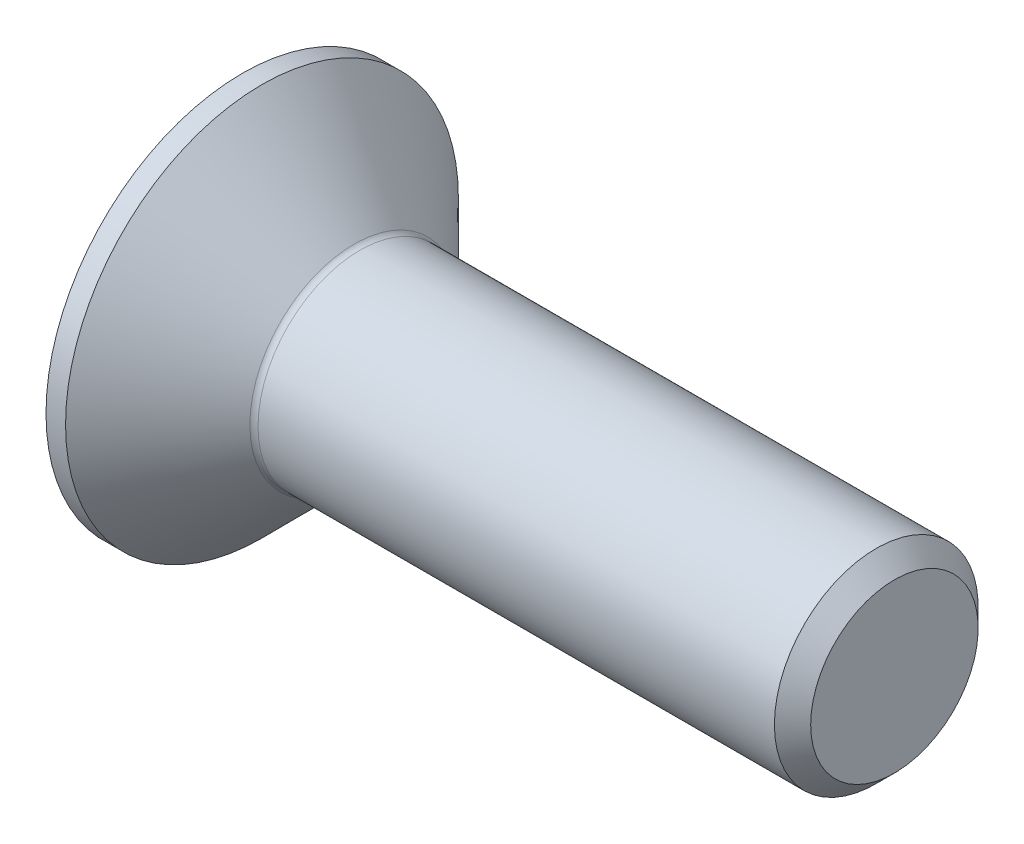
ISO-10303-21;
HEADER;
FILE_DESCRIPTION(('STEP AP214'),'2;1');
FILE_NAME('part.step','',(''),(''),'','','');
FILE_SCHEMA(('AUTOMOTIVE_DESIGN { 1 0 10303 214 1 1 1 1 }'));
ENDSEC;
DATA;
#1=APPLICATION_CONTEXT('core data for automotive mechanical design processes');
#2=APPLICATION_PROTOCOL_DEFINITION('international standard','automotive_design',2000,#1);
#3=PRODUCT_CONTEXT('',#1,'mechanical');
#4=PRODUCT('Part','Part','',(#3));
#5=PRODUCT_RELATED_PRODUCT_CATEGORY('part','',(#4));
#6=PRODUCT_DEFINITION_FORMATION('','',#4);
#7=PRODUCT_DEFINITION_CONTEXT('part definition',#1,'design');
#8=PRODUCT_DEFINITION('design','',#6,#7);
#9=PRODUCT_DEFINITION_SHAPE('','',#8);
#10=(LENGTH_UNIT() NAMED_UNIT(*) SI_UNIT(.MILLI.,.METRE.));
#11=(NAMED_UNIT(*) PLANE_ANGLE_UNIT() SI_UNIT($,.RADIAN.));
#12=(NAMED_UNIT(*) SI_UNIT($,.STERADIAN.) SOLID_ANGLE_UNIT());
#13=UNCERTAINTY_MEASURE_WITH_UNIT(LENGTH_MEASURE(1.E-05),#10,'distance_accuracy_value','');
#14=(GEOMETRIC_REPRESENTATION_CONTEXT(3) GLOBAL_UNCERTAINTY_ASSIGNED_CONTEXT((#13)) GLOBAL_UNIT_ASSIGNED_CONTEXT((#10,
#11,#12)) REPRESENTATION_CONTEXT('',''));
#15=CARTESIAN_POINT('',(0.,0.,0.));
#16=DIRECTION('',(0.,0.,1.));
#17=DIRECTION('',(1.,0.,0.));
#18=AXIS2_PLACEMENT_3D('',#15,#16,#17);
#19=CARTESIAN_POINT('',(0.,0.,0.));
#20=DIRECTION('',(-1.,0.,0.));
#21=DIRECTION('',(0.,0.,1.));
#22=AXIS2_PLACEMENT_3D('',#19,#20,#21);
#23=PLANE('',#22);
#24=CARTESIAN_POINT('',(0.,0.,0.));
#25=DIRECTION('',(-1.,0.,0.));
#26=DIRECTION('',(0.,0.,1.));
#27=AXIS2_PLACEMENT_3D('',#24,#25,#26);
#28=CIRCLE('',#27,4.82);
#29=CARTESIAN_POINT('',(0.,0.,4.82));
#30=VERTEX_POINT('',#29);
#31=EDGE_CURVE('E152',#30,#30,#28,.T.);
#32=ORIENTED_EDGE('',*,*,#31,.T.);
#33=EDGE_LOOP('',(#32));
#34=FACE_BOUND('',#33,.T.);
#35=DIRECTION('',(0.,-0.499999999999999,-0.866025403784439));
#36=VECTOR('',#35,1.);
#37=CARTESIAN_POINT('',(0.,-0.871798906476334,1.51));
#38=LINE('',#37,#36);
#39=CARTESIAN_POINT('',(0.,-0.871798906476334,1.51));
#40=VERTEX_POINT('',#39);
#41=CARTESIAN_POINT('',(0.,-1.74359781295267,0.));
#42=VERTEX_POINT('',#41);
#43=EDGE_CURVE('E118',#40,#42,#38,.T.);
#44=ORIENTED_EDGE('',*,*,#43,.T.);
#45=DIRECTION('',(0.,0.499999999999999,-0.866025403784439));
#46=VECTOR('',#45,1.);
#47=CARTESIAN_POINT('',(0.,-1.74359781295267,0.));
#48=LINE('',#47,#46);
#49=CARTESIAN_POINT('',(0.,-0.871798906476335,-1.51));
#50=VERTEX_POINT('',#49);
#51=EDGE_CURVE('E49',#42,#50,#48,.T.);
#52=ORIENTED_EDGE('',*,*,#51,.T.);
#53=DIRECTION('',(0.,1.,0.));
#54=VECTOR('',#53,1.);
#55=CARTESIAN_POINT('',(0.,-0.871798906476335,-1.51));
#56=LINE('',#55,#54);
#57=CARTESIAN_POINT('',(0.,0.871798906476334,-1.51));
#58=VERTEX_POINT('',#57);
#59=EDGE_CURVE('E129',#50,#58,#56,.T.);
#60=ORIENTED_EDGE('',*,*,#59,.T.);
#61=DIRECTION('',(0.,0.500000000000002,0.866025403784437));
#62=VECTOR('',#61,1.);
#63=CARTESIAN_POINT('',(0.,0.871798906476334,-1.51));
#64=LINE('',#63,#62);
#65=CARTESIAN_POINT('',(0.,1.74359781295267,0.));
#66=VERTEX_POINT('',#65);
#67=EDGE_CURVE('E253',#58,#66,#64,.T.);
#68=ORIENTED_EDGE('',*,*,#67,.T.);
#69=DIRECTION('',(0.,-0.500000000000001,0.866025403784438));
#70=VECTOR('',#69,1.);
#71=CARTESIAN_POINT('',(0.,1.74359781295267,0.));
#72=LINE('',#71,#70);
#73=CARTESIAN_POINT('',(0.,0.871798906476334,1.51));
#74=VERTEX_POINT('',#73);
#75=EDGE_CURVE('E256',#66,#74,#72,.T.);
#76=ORIENTED_EDGE('',*,*,#75,.T.);
#77=DIRECTION('',(0.,-1.,0.));
#78=VECTOR('',#77,1.);
#79=CARTESIAN_POINT('',(0.,0.871798906476334,1.51));
#80=LINE('',#79,#78);
#81=EDGE_CURVE('E259',#74,#40,#80,.T.);
#82=ORIENTED_EDGE('',*,*,#81,.T.);
#83=EDGE_LOOP('',(#44,#52,#60,#68,#76,#82));
#84=FACE_BOUND('',#83,.T.);
#85=ADVANCED_FACE('F34',(#34,#84),#23,.T.);
#86=CARTESIAN_POINT('',(0.,0.,0.));
#87=DIRECTION('',(-1.,0.,0.));
#88=DIRECTION('',(0.,0.,1.));
#89=AXIS2_PLACEMENT_3D('',#86,#87,#88);
#90=CYLINDRICAL_SURFACE('',#89,4.82);
#91=CARTESIAN_POINT('',(0.480000000000012,0.,0.));
#92=DIRECTION('',(-1.,0.,0.));
#93=DIRECTION('',(0.,0.,1.));
#94=AXIS2_PLACEMENT_3D('',#91,#92,#93);
#95=CIRCLE('',#94,4.82);
#96=CARTESIAN_POINT('',(0.480000000000012,0.,4.82));
#97=VERTEX_POINT('',#96);
#98=EDGE_CURVE('E149',#97,#97,#95,.T.);
#99=ORIENTED_EDGE('',*,*,#98,.T.);
#100=EDGE_LOOP('',(#99));
#101=FACE_BOUND('',#100,.T.);
#102=ORIENTED_EDGE('',*,*,#31,.F.);
#103=EDGE_LOOP('',(#102));
#104=FACE_BOUND('',#103,.T.);
#105=ADVANCED_FACE('F173',(#101,#104),#90,.T.);
#106=CARTESIAN_POINT('',(0.480000000000012,0.,0.));
#107=DIRECTION('',(-1.,0.,0.));
#108=DIRECTION('',(0.,0.,1.));
#109=AXIS2_PLACEMENT_3D('',#106,#107,#108);
#110=CONICAL_SURFACE('',#109,4.82,0.78539816339745);
#111=CARTESIAN_POINT('',(2.74142135623731,0.,0.));
#112=DIRECTION('',(-1.,0.,0.));
#113=DIRECTION('',(0.,0.,1.));
#114=AXIS2_PLACEMENT_3D('',#111,#112,#113);
#115=CIRCLE('',#114,2.55857864376269);
#116=CARTESIAN_POINT('',(2.74142135623731,0.,2.55857864376269));
#117=VERTEX_POINT('',#116);
#118=EDGE_CURVE('E42',#117,#117,#115,.T.);
#119=ORIENTED_EDGE('',*,*,#118,.T.);
#120=EDGE_LOOP('',(#119));
#121=FACE_BOUND('',#120,.T.);
#122=ORIENTED_EDGE('',*,*,#98,.F.);
#123=EDGE_LOOP('',(#122));
#124=FACE_BOUND('',#123,.T.);
#125=ADVANCED_FACE('F157',(#121,#124),#110,.T.);
#126=CARTESIAN_POINT('',(0.,0.,0.));
#127=DIRECTION('',(-1.,0.,0.));
#128=DIRECTION('',(0.,0.,1.));
#129=AXIS2_PLACEMENT_3D('',#126,#127,#128);
#130=CYLINDRICAL_SURFACE('',#129,2.5);
#131=CARTESIAN_POINT('',(2.88284271247462,0.,0.));
#132=DIRECTION('',(-1.,0.,0.));
#133=DIRECTION('',(0.,0.,1.));
#134=AXIS2_PLACEMENT_3D('',#131,#132,#133);
#135=CIRCLE('',#134,2.5);
#136=CARTESIAN_POINT('',(2.88284271247462,0.,2.5));
#137=VERTEX_POINT('',#136);
#138=EDGE_CURVE('E11',#137,#137,#135,.F.);
#139=ORIENTED_EDGE('',*,*,#138,.T.);
#140=EDGE_LOOP('',(#139));
#141=FACE_BOUND('',#140,.T.);
#142=CARTESIAN_POINT('',(15.555,0.,0.));
#143=DIRECTION('',(-1.,0.,0.));
#144=DIRECTION('',(0.,0.,1.));
#145=AXIS2_PLACEMENT_3D('',#142,#143,#144);
#146=CIRCLE('',#145,2.5);
#147=CARTESIAN_POINT('',(15.555,0.,2.5));
#148=VERTEX_POINT('',#147);
#149=EDGE_CURVE('E146',#148,#148,#146,.T.);
#150=ORIENTED_EDGE('',*,*,#149,.T.);
#151=EDGE_LOOP('',(#150));
#152=FACE_BOUND('',#151,.T.);
#153=ADVANCED_FACE('F184',(#141,#152),#130,.T.);
#154=CARTESIAN_POINT('',(16.,0.,0.));
#155=DIRECTION('',(-1.,0.,0.));
#156=DIRECTION('',(0.,0.,1.));
#157=AXIS2_PLACEMENT_3D('',#154,#155,#156);
#158=CONICAL_SURFACE('',#157,2.055,0.785398163397449);
#159=ORIENTED_EDGE('',*,*,#149,.F.);
#160=EDGE_LOOP('',(#159));
#161=FACE_BOUND('',#160,.T.);
#162=CARTESIAN_POINT('',(16.,0.,0.));
#163=DIRECTION('',(-1.,0.,0.));
#164=DIRECTION('',(0.,0.,1.));
#165=AXIS2_PLACEMENT_3D('',#162,#163,#164);
#166=CIRCLE('',#165,2.055);
#167=CARTESIAN_POINT('',(16.,0.,2.055));
#168=VERTEX_POINT('',#167);
#169=EDGE_CURVE('E142',#168,#168,#166,.T.);
#170=ORIENTED_EDGE('',*,*,#169,.T.);
#171=EDGE_LOOP('',(#170));
#172=FACE_BOUND('',#171,.T.);
#173=ADVANCED_FACE('F168',(#161,#172),#158,.T.);
#174=CARTESIAN_POINT('',(16.,2.055,0.));
#175=DIRECTION('',(1.,0.,0.));
#176=DIRECTION('',(0.,0.,-1.));
#177=AXIS2_PLACEMENT_3D('',#174,#175,#176);
#178=PLANE('',#177);
#179=ORIENTED_EDGE('',*,*,#169,.F.);
#180=EDGE_LOOP('',(#179));
#181=FACE_BOUND('',#180,.T.);
#182=ADVANCED_FACE('F161',(#181),#178,.T.);
#183=CARTESIAN_POINT('',(2.88284271247462,0.,0.));
#184=DIRECTION('',(-1.,0.,0.));
#185=DIRECTION('',(0.,0.,1.));
#186=AXIS2_PLACEMENT_3D('',#183,#184,#185);
#187=TOROIDAL_SURFACE('',#186,2.7,0.2);
#188=ORIENTED_EDGE('',*,*,#138,.F.);
#189=EDGE_LOOP('',(#188));
#190=FACE_BOUND('',#189,.T.);
#191=ORIENTED_EDGE('',*,*,#118,.F.);
#192=EDGE_LOOP('',(#191));
#193=FACE_BOUND('',#192,.T.);
#194=ADVANCED_FACE('F36',(#190,#193),#187,.F.);
#195=CARTESIAN_POINT('',(2.3,-1.74359781295267,0.));
#196=DIRECTION('',(0.,0.866025403784439,0.499999999999999));
#197=DIRECTION('',(0.,-0.499999999999999,0.866025403784439));
#198=AXIS2_PLACEMENT_3D('',#195,#196,#197);
#199=PLANE('',#198);
#200=ORIENTED_EDGE('',*,*,#51,.F.);
#201=DIRECTION('',(-1.,0.,0.));
#202=VECTOR('',#201,1.);
#203=CARTESIAN_POINT('',(2.3,-1.74359781295267,0.));
#204=LINE('',#203,#202);
#205=CARTESIAN_POINT('',(2.3,-1.74359781295267,0.));
#206=VERTEX_POINT('',#205);
#207=EDGE_CURVE('E250',#206,#42,#204,.T.);
#208=ORIENTED_EDGE('',*,*,#207,.F.);
#209=DIRECTION('',(0.,0.499999999999999,-0.866025403784439));
#210=VECTOR('',#209,1.);
#211=CARTESIAN_POINT('',(2.3,-1.74359781295267,0.));
#212=LINE('',#211,#210);
#213=CARTESIAN_POINT('',(2.3,-1.3076983597145,-0.754999999999997));
#214=VERTEX_POINT('',#213);
#215=EDGE_CURVE('E114',#206,#214,#212,.T.);
#216=ORIENTED_EDGE('',*,*,#215,.T.);
#217=CARTESIAN_POINT('',(2.3,-0.871798906476335,-1.51));
#218=VERTEX_POINT('',#217);
#219=EDGE_CURVE('E110',#214,#218,#212,.T.);
#220=ORIENTED_EDGE('',*,*,#219,.T.);
#221=DIRECTION('',(-1.,0.,0.));
#222=VECTOR('',#221,1.);
#223=CARTESIAN_POINT('',(2.3,-0.871798906476335,-1.51));
#224=LINE('',#223,#222);
#225=EDGE_CURVE('E112',#218,#50,#224,.T.);
#226=ORIENTED_EDGE('',*,*,#225,.T.);
#227=EDGE_LOOP('',(#200,#208,#216,#220,#226));
#228=FACE_BOUND('',#227,.T.);
#229=ADVANCED_FACE('F111',(#228),#199,.T.);
#230=CARTESIAN_POINT('',(2.3,-0.871798906476335,-1.51));
#231=DIRECTION('',(0.,0.,1.));
#232=DIRECTION('',(0.,-1.,0.));
#233=AXIS2_PLACEMENT_3D('',#230,#231,#232);
#234=PLANE('',#233);
#235=ORIENTED_EDGE('',*,*,#59,.F.);
#236=ORIENTED_EDGE('',*,*,#225,.F.);
#237=DIRECTION('',(0.,1.,0.));
#238=VECTOR('',#237,1.);
#239=CARTESIAN_POINT('',(2.3,-0.871798906476335,-1.51));
#240=LINE('',#239,#238);
#241=CARTESIAN_POINT('',(2.3,0.,-1.51));
#242=VERTEX_POINT('',#241);
#243=EDGE_CURVE('E57',#218,#242,#240,.T.);
#244=ORIENTED_EDGE('',*,*,#243,.T.);
#245=CARTESIAN_POINT('',(2.3,0.871798906476334,-1.51));
#246=VERTEX_POINT('',#245);
#247=EDGE_CURVE('E124',#242,#246,#240,.T.);
#248=ORIENTED_EDGE('',*,*,#247,.T.);
#249=DIRECTION('',(-1.,0.,0.));
#250=VECTOR('',#249,1.);
#251=CARTESIAN_POINT('',(2.3,0.871798906476334,-1.51));
#252=LINE('',#251,#250);
#253=EDGE_CURVE('E131',#246,#58,#252,.T.);
#254=ORIENTED_EDGE('',*,*,#253,.T.);
#255=EDGE_LOOP('',(#235,#236,#244,#248,#254));
#256=FACE_BOUND('',#255,.T.);
#257=ADVANCED_FACE('F126',(#256),#234,.T.);
#258=CARTESIAN_POINT('',(2.3,0.871798906476334,-1.51));
#259=DIRECTION('',(0.,-0.866025403784437,0.500000000000002));
#260=DIRECTION('',(0.,-0.500000000000002,-0.866025403784437));
#261=AXIS2_PLACEMENT_3D('',#258,#259,#260);
#262=PLANE('',#261);
#263=ORIENTED_EDGE('',*,*,#67,.F.);
#264=ORIENTED_EDGE('',*,*,#253,.F.);
#265=DIRECTION('',(0.,0.500000000000002,0.866025403784437));
#266=VECTOR('',#265,1.);
#267=CARTESIAN_POINT('',(2.3,0.871798906476334,-1.51));
#268=LINE('',#267,#266);
#269=CARTESIAN_POINT('',(2.3,1.3076983597145,-0.755000000000003));
#270=VERTEX_POINT('',#269);
#271=EDGE_CURVE('E231',#246,#270,#268,.T.);
#272=ORIENTED_EDGE('',*,*,#271,.T.);
#273=CARTESIAN_POINT('',(2.3,1.74359781295267,0.));
#274=VERTEX_POINT('',#273);
#275=EDGE_CURVE('E123',#270,#274,#268,.T.);
#276=ORIENTED_EDGE('',*,*,#275,.T.);
#277=DIRECTION('',(-1.,0.,0.));
#278=VECTOR('',#277,1.);
#279=CARTESIAN_POINT('',(2.3,1.74359781295267,0.));
#280=LINE('',#279,#278);
#281=EDGE_CURVE('E137',#274,#66,#280,.T.);
#282=ORIENTED_EDGE('',*,*,#281,.T.);
#283=EDGE_LOOP('',(#263,#264,#272,#276,#282));
#284=FACE_BOUND('',#283,.T.);
#285=ADVANCED_FACE('F198',(#284),#262,.T.);
#286=CARTESIAN_POINT('',(2.3,1.74359781295267,0.));
#287=DIRECTION('',(0.,-0.866025403784438,-0.500000000000001));
#288=DIRECTION('',(0.,0.500000000000001,-0.866025403784438));
#289=AXIS2_PLACEMENT_3D('',#286,#287,#288);
#290=PLANE('',#289);
#291=ORIENTED_EDGE('',*,*,#75,.F.);
#292=ORIENTED_EDGE('',*,*,#281,.F.);
#293=DIRECTION('',(0.,-0.500000000000001,0.866025403784438));
#294=VECTOR('',#293,1.);
#295=CARTESIAN_POINT('',(2.3,1.74359781295267,0.));
#296=LINE('',#295,#294);
#297=CARTESIAN_POINT('',(2.3,1.3076983597145,0.755000000000001));
#298=VERTEX_POINT('',#297);
#299=EDGE_CURVE('E238',#274,#298,#296,.T.);
#300=ORIENTED_EDGE('',*,*,#299,.T.);
#301=CARTESIAN_POINT('',(2.3,0.871798906476334,1.51));
#302=VERTEX_POINT('',#301);
#303=EDGE_CURVE('E236',#298,#302,#296,.T.);
#304=ORIENTED_EDGE('',*,*,#303,.T.);
#305=DIRECTION('',(-1.,0.,0.));
#306=VECTOR('',#305,1.);
#307=CARTESIAN_POINT('',(2.3,0.871798906476334,1.51));
#308=LINE('',#307,#306);
#309=EDGE_CURVE('E268',#302,#74,#308,.T.);
#310=ORIENTED_EDGE('',*,*,#309,.T.);
#311=EDGE_LOOP('',(#291,#292,#300,#304,#310));
#312=FACE_BOUND('',#311,.T.);
#313=ADVANCED_FACE('F201',(#312),#290,.T.);
#314=CARTESIAN_POINT('',(2.3,0.871798906476334,1.51));
#315=DIRECTION('',(0.,0.,-1.));
#316=DIRECTION('',(-1.,0.,0.));
#317=AXIS2_PLACEMENT_3D('',#314,#315,#316);
#318=PLANE('',#317);
#319=ORIENTED_EDGE('',*,*,#81,.F.);
#320=ORIENTED_EDGE('',*,*,#309,.F.);
#321=DIRECTION('',(0.,-1.,0.));
#322=VECTOR('',#321,1.);
#323=CARTESIAN_POINT('',(2.3,0.871798906476334,1.51));
#324=LINE('',#323,#322);
#325=CARTESIAN_POINT('',(2.3,0.,1.51));
#326=VERTEX_POINT('',#325);
#327=EDGE_CURVE('E243',#302,#326,#324,.T.);
#328=ORIENTED_EDGE('',*,*,#327,.T.);
#329=CARTESIAN_POINT('',(2.3,-0.871798906476334,1.51));
#330=VERTEX_POINT('',#329);
#331=EDGE_CURVE('E242',#326,#330,#324,.T.);
#332=ORIENTED_EDGE('',*,*,#331,.T.);
#333=DIRECTION('',(-1.,0.,0.));
#334=VECTOR('',#333,1.);
#335=CARTESIAN_POINT('',(2.3,-0.871798906476334,1.51));
#336=LINE('',#335,#334);
#337=EDGE_CURVE('E265',#330,#40,#336,.T.);
#338=ORIENTED_EDGE('',*,*,#337,.T.);
#339=EDGE_LOOP('',(#319,#320,#328,#332,#338));
#340=FACE_BOUND('',#339,.T.);
#341=ADVANCED_FACE('F205',(#340),#318,.T.);
#342=CARTESIAN_POINT('',(2.3,-0.871798906476334,1.51));
#343=DIRECTION('',(0.,0.866025403784439,-0.499999999999999));
#344=DIRECTION('',(0.,0.499999999999999,0.866025403784439));
#345=AXIS2_PLACEMENT_3D('',#342,#343,#344);
#346=PLANE('',#345);
#347=ORIENTED_EDGE('',*,*,#43,.F.);
#348=ORIENTED_EDGE('',*,*,#337,.F.);
#349=DIRECTION('',(0.,-0.499999999999999,-0.866025403784439));
#350=VECTOR('',#349,1.);
#351=CARTESIAN_POINT('',(2.3,-0.871798906476334,1.51));
#352=LINE('',#351,#350);
#353=CARTESIAN_POINT('',(2.3,-1.3076983597145,0.754999999999998));
#354=VERTEX_POINT('',#353);
#355=EDGE_CURVE('E247',#330,#354,#352,.T.);
#356=ORIENTED_EDGE('',*,*,#355,.T.);
#357=EDGE_CURVE('E246',#354,#206,#352,.T.);
#358=ORIENTED_EDGE('',*,*,#357,.T.);
#359=ORIENTED_EDGE('',*,*,#207,.T.);
#360=EDGE_LOOP('',(#347,#348,#356,#358,#359));
#361=FACE_BOUND('',#360,.T.);
#362=ADVANCED_FACE('F209',(#361),#346,.T.);
#363=CARTESIAN_POINT('',(2.3,-0.871798906476334,-1.51));
#364=DIRECTION('',(1.,0.,0.));
#365=DIRECTION('',(0.,0.,-1.));
#366=AXIS2_PLACEMENT_3D('',#363,#364,#365);
#367=PLANE('',#366);
#368=ORIENTED_EDGE('',*,*,#243,.F.);
#369=ORIENTED_EDGE('',*,*,#219,.F.);
#370=CARTESIAN_POINT('',(2.3,0.,0.));
#371=DIRECTION('',(-1.,0.,0.));
#372=DIRECTION('',(0.,0.,1.));
#373=AXIS2_PLACEMENT_3D('',#370,#371,#372);
#374=CIRCLE('',#373,1.51);
#375=EDGE_CURVE('E121',#242,#214,#374,.T.);
#376=ORIENTED_EDGE('',*,*,#375,.F.);
#377=EDGE_LOOP('',(#368,#369,#376));
#378=FACE_BOUND('',#377,.T.);
#379=ADVANCED_FACE('F120',(#378),#367,.F.);
#380=ORIENTED_EDGE('',*,*,#215,.F.);
#381=ORIENTED_EDGE('',*,*,#357,.F.);
#382=EDGE_CURVE('E134',#214,#354,#374,.T.);
#383=ORIENTED_EDGE('',*,*,#382,.F.);
#384=EDGE_LOOP('',(#380,#381,#383));
#385=FACE_BOUND('',#384,.T.);
#386=ADVANCED_FACE('F215',(#385),#367,.F.);
#387=ORIENTED_EDGE('',*,*,#355,.F.);
#388=ORIENTED_EDGE('',*,*,#331,.F.);
#389=EDGE_CURVE('E130',#354,#326,#374,.T.);
#390=ORIENTED_EDGE('',*,*,#389,.F.);
#391=EDGE_LOOP('',(#387,#388,#390));
#392=FACE_BOUND('',#391,.T.);
#393=ADVANCED_FACE('F219',(#392),#367,.F.);
#394=ORIENTED_EDGE('',*,*,#327,.F.);
#395=ORIENTED_EDGE('',*,*,#303,.F.);
#396=EDGE_CURVE('E136',#326,#298,#374,.T.);
#397=ORIENTED_EDGE('',*,*,#396,.F.);
#398=EDGE_LOOP('',(#394,#395,#397));
#399=FACE_BOUND('',#398,.T.);
#400=ADVANCED_FACE('F227',(#399),#367,.F.);
#401=ORIENTED_EDGE('',*,*,#299,.F.);
#402=ORIENTED_EDGE('',*,*,#275,.F.);
#403=EDGE_CURVE('E143',#298,#270,#374,.T.);
#404=ORIENTED_EDGE('',*,*,#403,.F.);
#405=EDGE_LOOP('',(#401,#402,#404));
#406=FACE_BOUND('',#405,.T.);
#407=ADVANCED_FACE('F222',(#406),#367,.F.);
#408=ORIENTED_EDGE('',*,*,#271,.F.);
#409=ORIENTED_EDGE('',*,*,#247,.F.);
#410=EDGE_CURVE('E232',#270,#242,#374,.T.);
#411=ORIENTED_EDGE('',*,*,#410,.F.);
#412=EDGE_LOOP('',(#408,#409,#411));
#413=FACE_BOUND('',#412,.T.);
#414=ADVANCED_FACE('F193',(#413),#367,.F.);
#415=CARTESIAN_POINT('',(2.3,0.,0.));
#416=DIRECTION('',(-1.,0.,0.));
#417=DIRECTION('',(0.,0.,1.));
#418=AXIS2_PLACEMENT_3D('',#415,#416,#417);
#419=CONICAL_SURFACE('',#418,1.51,1.04719755119659);
#420=CARTESIAN_POINT('',(3.17179890647635,0.,0.));
#421=VERTEX_POINT('',#420);
#422=VERTEX_LOOP('',#421);
#423=FACE_BOUND('',#422,.T.);
#424=ORIENTED_EDGE('',*,*,#396,.T.);
#425=ORIENTED_EDGE('',*,*,#403,.T.);
#426=ORIENTED_EDGE('',*,*,#410,.T.);
#427=ORIENTED_EDGE('',*,*,#375,.T.);
#428=ORIENTED_EDGE('',*,*,#382,.T.);
#429=ORIENTED_EDGE('',*,*,#389,.T.);
#430=EDGE_LOOP('',(#424,#425,#426,#427,#428,#429));
#431=FACE_BOUND('',#430,.T.);
#432=ADVANCED_FACE('F191',(#423,#431),#419,.F.);
#433=CLOSED_SHELL('',(#85,#105,#125,#153,#173,#182,#194,#229,#257,#285,#313,#341,#362,#379,#386,
#393,#400,#407,#414,#432));
#434=MANIFOLD_SOLID_BREP('B2',#433);
#435=ADVANCED_BREP_SHAPE_REPRESENTATION('',(#18,#434),#14);
#436=SHAPE_DEFINITION_REPRESENTATION(#9,#435);
ENDSEC;
END-ISO-10303-21;
